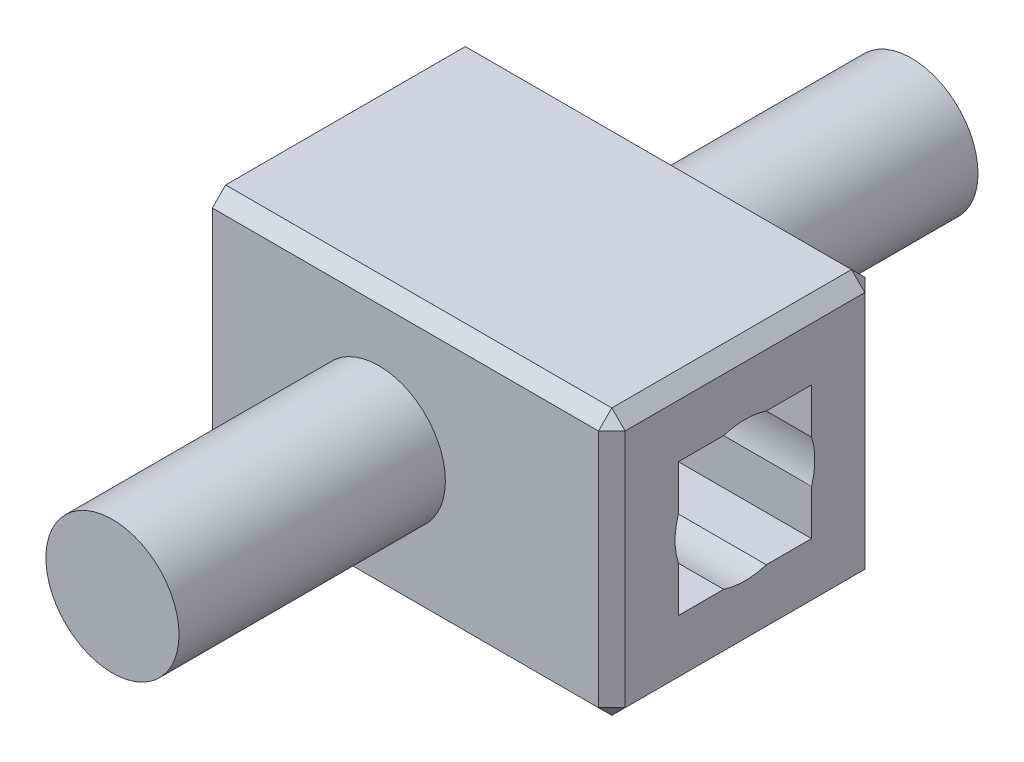
ISO-10303-21;
HEADER;
FILE_DESCRIPTION(('STEP AP214'),'2;1');
FILE_NAME('part.step','',(''),(''),'','','');
FILE_SCHEMA(('AUTOMOTIVE_DESIGN { 1 0 10303 214 1 1 1 1 }'));
ENDSEC;
DATA;
#1=APPLICATION_CONTEXT('core data for automotive mechanical design processes');
#2=APPLICATION_PROTOCOL_DEFINITION('international standard','automotive_design',2000,#1);
#3=PRODUCT_CONTEXT('',#1,'mechanical');
#4=PRODUCT('Part','Part','',(#3));
#5=PRODUCT_RELATED_PRODUCT_CATEGORY('part','',(#4));
#6=PRODUCT_DEFINITION_FORMATION('','',#4);
#7=PRODUCT_DEFINITION_CONTEXT('part definition',#1,'design');
#8=PRODUCT_DEFINITION('design','',#6,#7);
#9=PRODUCT_DEFINITION_SHAPE('','',#8);
#10=(LENGTH_UNIT() NAMED_UNIT(*) SI_UNIT(.MILLI.,.METRE.));
#11=(NAMED_UNIT(*) PLANE_ANGLE_UNIT() SI_UNIT($,.RADIAN.));
#12=(NAMED_UNIT(*) SI_UNIT($,.STERADIAN.) SOLID_ANGLE_UNIT());
#13=UNCERTAINTY_MEASURE_WITH_UNIT(LENGTH_MEASURE(1.E-05),#10,'distance_accuracy_value','');
#14=(GEOMETRIC_REPRESENTATION_CONTEXT(3) GLOBAL_UNCERTAINTY_ASSIGNED_CONTEXT((#13)) GLOBAL_UNIT_ASSIGNED_CONTEXT((#10,
#11,#12)) REPRESENTATION_CONTEXT('',''));
#15=CARTESIAN_POINT('',(0.,0.,0.));
#16=DIRECTION('',(0.,0.,1.));
#17=DIRECTION('',(1.,0.,0.));
#18=AXIS2_PLACEMENT_3D('',#15,#16,#17);
#19=CARTESIAN_POINT('',(-125.,50.,50.));
#20=DIRECTION('',(0.,0.,-1.));
#21=DIRECTION('',(0.,1.,0.));
#22=AXIS2_PLACEMENT_3D('',#19,#20,#21);
#23=PLANE('',#22);
#24=DIRECTION('',(0.,1.,0.));
#25=VECTOR('',#24,1.);
#26=CARTESIAN_POINT('',(-125.,50.,50.));
#27=LINE('',#26,#25);
#28=CARTESIAN_POINT('',(-125.,16.007810593582,50.));
#29=VERTEX_POINT('',#28);
#30=CARTESIAN_POINT('',(-125.,50.,50.));
#31=VERTEX_POINT('',#30);
#32=EDGE_CURVE('E252',#29,#31,#27,.T.);
#33=ORIENTED_EDGE('',*,*,#32,.F.);
#34=DIRECTION('',(1.,0.,0.));
#35=VECTOR('',#34,1.);
#36=CARTESIAN_POINT('',(-125.,16.007810593582,50.));
#37=LINE('',#36,#35);
#38=CARTESIAN_POINT('',(175.,16.0078105935821,50.));
#39=VERTEX_POINT('',#38);
#40=EDGE_CURVE('E537',#29,#39,#37,.T.);
#41=ORIENTED_EDGE('',*,*,#40,.T.);
#42=DIRECTION('',(0.,1.,0.));
#43=VECTOR('',#42,1.);
#44=CARTESIAN_POINT('',(175.,50.,50.));
#45=LINE('',#44,#43);
#46=CARTESIAN_POINT('',(175.,50.,50.));
#47=VERTEX_POINT('',#46);
#48=EDGE_CURVE('E241',#39,#47,#45,.T.);
#49=ORIENTED_EDGE('',*,*,#48,.T.);
#50=DIRECTION('',(1.,0.,0.));
#51=VECTOR('',#50,1.);
#52=CARTESIAN_POINT('',(-125.,50.,50.));
#53=LINE('',#52,#51);
#54=EDGE_CURVE('E264',#31,#47,#53,.T.);
#55=ORIENTED_EDGE('',*,*,#54,.F.);
#56=EDGE_LOOP('',(#33,#41,#49,#55));
#57=FACE_BOUND('',#56,.T.);
#58=ADVANCED_FACE('F51',(#57),#23,.F.);
#59=CARTESIAN_POINT('',(-125.,-50.0000000000001,150.));
#60=DIRECTION('',(0.,-1.,0.));
#61=DIRECTION('',(1.,0.,0.));
#62=AXIS2_PLACEMENT_3D('',#59,#60,#61);
#63=PLANE('',#62);
#64=DIRECTION('',(0.,0.,-1.));
#65=VECTOR('',#64,1.);
#66=CARTESIAN_POINT('',(-125.,-50.0000000000001,150.));
#67=LINE('',#66,#65);
#68=CARTESIAN_POINT('',(-125.,-50.0000000000001,83.9921894064179));
#69=VERTEX_POINT('',#68);
#70=CARTESIAN_POINT('',(-125.,-50.0000000000001,50.));
#71=VERTEX_POINT('',#70);
#72=EDGE_CURVE('E551',#69,#71,#67,.T.);
#73=ORIENTED_EDGE('',*,*,#72,.F.);
#74=DIRECTION('',(1.,0.,0.));
#75=VECTOR('',#74,1.);
#76=CARTESIAN_POINT('',(-125.,-50.0000000000001,83.9921894064179));
#77=LINE('',#76,#75);
#78=CARTESIAN_POINT('',(175.,-50.,83.9921894064179));
#79=VERTEX_POINT('',#78);
#80=EDGE_CURVE('E531',#69,#79,#77,.T.);
#81=ORIENTED_EDGE('',*,*,#80,.T.);
#82=DIRECTION('',(0.,0.,-1.));
#83=VECTOR('',#82,1.);
#84=CARTESIAN_POINT('',(175.,-50.,150.));
#85=LINE('',#84,#83);
#86=CARTESIAN_POINT('',(175.,-50.,50.));
#87=VERTEX_POINT('',#86);
#88=EDGE_CURVE('E247',#79,#87,#85,.T.);
#89=ORIENTED_EDGE('',*,*,#88,.T.);
#90=DIRECTION('',(1.,0.,0.));
#91=VECTOR('',#90,1.);
#92=CARTESIAN_POINT('',(-125.,-50.0000000000001,50.));
#93=LINE('',#92,#91);
#94=EDGE_CURVE('E253',#71,#87,#93,.T.);
#95=ORIENTED_EDGE('',*,*,#94,.F.);
#96=EDGE_LOOP('',(#73,#81,#89,#95));
#97=FACE_BOUND('',#96,.T.);
#98=ADVANCED_FACE('F475',(#97),#63,.F.);
#99=CARTESIAN_POINT('',(-125.,50.,150.));
#100=DIRECTION('',(0.,0.,1.));
#101=DIRECTION('',(1.,0.,0.));
#102=AXIS2_PLACEMENT_3D('',#99,#100,#101);
#103=PLANE('',#102);
#104=DIRECTION('',(0.,-1.,0.));
#105=VECTOR('',#104,1.);
#106=CARTESIAN_POINT('',(-125.,50.,150.));
#107=LINE('',#106,#105);
#108=CARTESIAN_POINT('',(-125.,-16.0078105935822,150.));
#109=VERTEX_POINT('',#108);
#110=CARTESIAN_POINT('',(-125.,-50.0000000000001,150.));
#111=VERTEX_POINT('',#110);
#112=EDGE_CURVE('E547',#109,#111,#107,.T.);
#113=ORIENTED_EDGE('',*,*,#112,.F.);
#114=DIRECTION('',(1.,0.,0.));
#115=VECTOR('',#114,1.);
#116=CARTESIAN_POINT('',(-125.,-16.0078105935822,150.));
#117=LINE('',#116,#115);
#118=CARTESIAN_POINT('',(175.,-16.0078105935821,150.));
#119=VERTEX_POINT('',#118);
#120=EDGE_CURVE('E522',#109,#119,#117,.T.);
#121=ORIENTED_EDGE('',*,*,#120,.T.);
#122=DIRECTION('',(0.,-1.,0.));
#123=VECTOR('',#122,1.);
#124=CARTESIAN_POINT('',(175.,50.,150.));
#125=LINE('',#124,#123);
#126=CARTESIAN_POINT('',(175.,-50.,150.));
#127=VERTEX_POINT('',#126);
#128=EDGE_CURVE('E238',#119,#127,#125,.T.);
#129=ORIENTED_EDGE('',*,*,#128,.T.);
#130=DIRECTION('',(1.,0.,0.));
#131=VECTOR('',#130,1.);
#132=CARTESIAN_POINT('',(-125.,-50.0000000000001,150.));
#133=LINE('',#132,#131);
#134=EDGE_CURVE('E258',#111,#127,#133,.T.);
#135=ORIENTED_EDGE('',*,*,#134,.F.);
#136=EDGE_LOOP('',(#113,#121,#129,#135));
#137=FACE_BOUND('',#136,.T.);
#138=ADVANCED_FACE('F481',(#137),#103,.F.);
#139=CARTESIAN_POINT('',(-125.,50.,150.));
#140=DIRECTION('',(0.,1.,0.));
#141=DIRECTION('',(-1.,0.,0.));
#142=AXIS2_PLACEMENT_3D('',#139,#140,#141);
#143=PLANE('',#142);
#144=DIRECTION('',(0.,0.,1.));
#145=VECTOR('',#144,1.);
#146=CARTESIAN_POINT('',(-125.,50.,150.));
#147=LINE('',#146,#145);
#148=CARTESIAN_POINT('',(-125.,50.,116.007810593582));
#149=VERTEX_POINT('',#148);
#150=CARTESIAN_POINT('',(-125.,50.,150.));
#151=VERTEX_POINT('',#150);
#152=EDGE_CURVE('E220',#149,#151,#147,.T.);
#153=ORIENTED_EDGE('',*,*,#152,.F.);
#154=DIRECTION('',(1.,0.,0.));
#155=VECTOR('',#154,1.);
#156=CARTESIAN_POINT('',(-125.,50.,116.007810593582));
#157=LINE('',#156,#155);
#158=CARTESIAN_POINT('',(175.,50.,116.007810593582));
#159=VERTEX_POINT('',#158);
#160=EDGE_CURVE('E202',#149,#159,#157,.T.);
#161=ORIENTED_EDGE('',*,*,#160,.T.);
#162=DIRECTION('',(0.,0.,1.));
#163=VECTOR('',#162,1.);
#164=CARTESIAN_POINT('',(175.,50.,150.));
#165=LINE('',#164,#163);
#166=CARTESIAN_POINT('',(175.,50.,150.));
#167=VERTEX_POINT('',#166);
#168=EDGE_CURVE('E218',#159,#167,#165,.T.);
#169=ORIENTED_EDGE('',*,*,#168,.T.);
#170=DIRECTION('',(1.,0.,0.));
#171=VECTOR('',#170,1.);
#172=CARTESIAN_POINT('',(-125.,50.,150.));
#173=LINE('',#172,#171);
#174=EDGE_CURVE('E261',#151,#167,#173,.T.);
#175=ORIENTED_EDGE('',*,*,#174,.F.);
#176=EDGE_LOOP('',(#153,#161,#169,#175));
#177=FACE_BOUND('',#176,.T.);
#178=ADVANCED_FACE('F216',(#177),#143,.F.);
#179=CARTESIAN_POINT('',(175.,100.,200.));
#180=DIRECTION('',(-1.,0.,0.));
#181=DIRECTION('',(0.,-1.,0.));
#182=AXIS2_PLACEMENT_3D('',#179,#180,#181);
#183=PLANE('',#182);
#184=DIRECTION('',(0.,-1.,0.));
#185=VECTOR('',#184,1.);
#186=CARTESIAN_POINT('',(175.,100.,190.));
#187=LINE('',#186,#185);
#188=CARTESIAN_POINT('',(175.,89.9999999999999,190.));
#189=VERTEX_POINT('',#188);
#190=CARTESIAN_POINT('',(175.,-90.,190.));
#191=VERTEX_POINT('',#190);
#192=EDGE_CURVE('E344',#189,#191,#187,.T.);
#193=ORIENTED_EDGE('',*,*,#192,.T.);
#194=DIRECTION('',(0.,0.,-1.));
#195=VECTOR('',#194,1.);
#196=CARTESIAN_POINT('',(175.,-90.,200.));
#197=LINE('',#196,#195);
#198=CARTESIAN_POINT('',(175.,-90.,10.));
#199=VERTEX_POINT('',#198);
#200=EDGE_CURVE('E349',#191,#199,#197,.T.);
#201=ORIENTED_EDGE('',*,*,#200,.T.);
#202=DIRECTION('',(0.,1.,0.));
#203=VECTOR('',#202,1.);
#204=CARTESIAN_POINT('',(175.,100.,10.));
#205=LINE('',#204,#203);
#206=CARTESIAN_POINT('',(175.,89.9999999999999,10.));
#207=VERTEX_POINT('',#206);
#208=EDGE_CURVE('E346',#199,#207,#205,.T.);
#209=ORIENTED_EDGE('',*,*,#208,.T.);
#210=DIRECTION('',(0.,0.,1.));
#211=VECTOR('',#210,1.);
#212=CARTESIAN_POINT('',(175.,89.9999999999999,200.));
#213=LINE('',#212,#211);
#214=EDGE_CURVE('E341',#207,#189,#213,.T.);
#215=ORIENTED_EDGE('',*,*,#214,.T.);
#216=EDGE_LOOP('',(#193,#201,#209,#215));
#217=FACE_BOUND('',#216,.T.);
#218=ORIENTED_EDGE('',*,*,#128,.F.);
#219=CARTESIAN_POINT('',(175.,0.,100.));
#220=DIRECTION('',(1.,0.,0.));
#221=DIRECTION('',(0.,1.,0.));
#222=AXIS2_PLACEMENT_3D('',#219,#220,#221);
#223=CIRCLE('',#222,52.5);
#224=CARTESIAN_POINT('',(175.,16.0078105935822,150.));
#225=VERTEX_POINT('',#224);
#226=EDGE_CURVE('E213',#225,#119,#223,.T.);
#227=ORIENTED_EDGE('',*,*,#226,.F.);
#228=EDGE_CURVE('E229',#167,#225,#125,.T.);
#229=ORIENTED_EDGE('',*,*,#228,.F.);
#230=ORIENTED_EDGE('',*,*,#168,.F.);
#231=CARTESIAN_POINT('',(175.,50.,83.9921894064179));
#232=VERTEX_POINT('',#231);
#233=EDGE_CURVE('E199',#232,#159,#223,.T.);
#234=ORIENTED_EDGE('',*,*,#233,.F.);
#235=EDGE_CURVE('E231',#47,#232,#165,.T.);
#236=ORIENTED_EDGE('',*,*,#235,.F.);
#237=ORIENTED_EDGE('',*,*,#48,.F.);
#238=CARTESIAN_POINT('',(175.,-16.007810593582,50.));
#239=VERTEX_POINT('',#238);
#240=EDGE_CURVE('E211',#239,#39,#223,.T.);
#241=ORIENTED_EDGE('',*,*,#240,.F.);
#242=EDGE_CURVE('E232',#87,#239,#45,.T.);
#243=ORIENTED_EDGE('',*,*,#242,.F.);
#244=ORIENTED_EDGE('',*,*,#88,.F.);
#245=CARTESIAN_POINT('',(175.,-50.,116.007810593582));
#246=VERTEX_POINT('',#245);
#247=EDGE_CURVE('E511',#246,#79,#223,.T.);
#248=ORIENTED_EDGE('',*,*,#247,.F.);
#249=EDGE_CURVE('E248',#127,#246,#85,.T.);
#250=ORIENTED_EDGE('',*,*,#249,.F.);
#251=EDGE_LOOP('',(#218,#227,#229,#230,#234,#236,#237,#241,#243,#244,#248,#250));
#252=FACE_BOUND('',#251,.T.);
#253=ADVANCED_FACE('F226',(#217,#252),#183,.F.);
#254=CARTESIAN_POINT('',(-125.,100.,200.));
#255=DIRECTION('',(0.,-1.,0.));
#256=DIRECTION('',(0.,0.,-1.));
#257=AXIS2_PLACEMENT_3D('',#254,#255,#256);
#258=PLANE('',#257);
#259=DIRECTION('',(0.,0.,-1.));
#260=VECTOR('',#259,1.);
#261=CARTESIAN_POINT('',(-125.,100.,200.));
#262=LINE('',#261,#260);
#263=CARTESIAN_POINT('',(-125.,100.,190.));
#264=VERTEX_POINT('',#263);
#265=CARTESIAN_POINT('',(-125.,100.,10.));
#266=VERTEX_POINT('',#265);
#267=EDGE_CURVE('E292',#264,#266,#262,.T.);
#268=ORIENTED_EDGE('',*,*,#267,.F.);
#269=DIRECTION('',(1.,0.,0.));
#270=VECTOR('',#269,1.);
#271=CARTESIAN_POINT('',(-125.,100.,190.));
#272=LINE('',#271,#270);
#273=CARTESIAN_POINT('',(165.,100.,190.));
#274=VERTEX_POINT('',#273);
#275=EDGE_CURVE('E11',#264,#274,#272,.T.);
#276=ORIENTED_EDGE('',*,*,#275,.T.);
#277=DIRECTION('',(0.,0.,-1.));
#278=VECTOR('',#277,1.);
#279=CARTESIAN_POINT('',(165.,100.,200.));
#280=LINE('',#279,#278);
#281=CARTESIAN_POINT('',(165.,100.,10.));
#282=VERTEX_POINT('',#281);
#283=EDGE_CURVE('E62',#274,#282,#280,.T.);
#284=ORIENTED_EDGE('',*,*,#283,.T.);
#285=DIRECTION('',(-1.,0.,0.));
#286=VECTOR('',#285,1.);
#287=CARTESIAN_POINT('',(-125.,100.,10.));
#288=LINE('',#287,#286);
#289=EDGE_CURVE('E353',#282,#266,#288,.T.);
#290=ORIENTED_EDGE('',*,*,#289,.T.);
#291=EDGE_LOOP('',(#268,#276,#284,#290));
#292=FACE_BOUND('',#291,.T.);
#293=ADVANCED_FACE('F413',(#292),#258,.F.);
#294=CARTESIAN_POINT('',(-125.,100.,200.));
#295=DIRECTION('',(1.,0.,0.));
#296=DIRECTION('',(0.,1.,0.));
#297=AXIS2_PLACEMENT_3D('',#294,#295,#296);
#298=PLANE('',#297);
#299=CARTESIAN_POINT('',(-125.,16.0078105935821,150.));
#300=VERTEX_POINT('',#299);
#301=EDGE_CURVE('E548',#151,#300,#107,.T.);
#302=ORIENTED_EDGE('',*,*,#301,.T.);
#303=CARTESIAN_POINT('',(-125.,0.,100.));
#304=DIRECTION('',(1.,0.,0.));
#305=DIRECTION('',(0.,1.,0.));
#306=AXIS2_PLACEMENT_3D('',#303,#304,#305);
#307=CIRCLE('',#306,52.5);
#308=EDGE_CURVE('E523',#300,#109,#307,.T.);
#309=ORIENTED_EDGE('',*,*,#308,.T.);
#310=ORIENTED_EDGE('',*,*,#112,.T.);
#311=CARTESIAN_POINT('',(-125.,-50.0000000000001,116.007810593582));
#312=VERTEX_POINT('',#311);
#313=EDGE_CURVE('E268',#111,#312,#67,.T.);
#314=ORIENTED_EDGE('',*,*,#313,.T.);
#315=EDGE_CURVE('E562',#312,#69,#307,.T.);
#316=ORIENTED_EDGE('',*,*,#315,.T.);
#317=ORIENTED_EDGE('',*,*,#72,.T.);
#318=CARTESIAN_POINT('',(-125.,-16.0078105935821,50.));
#319=VERTEX_POINT('',#318);
#320=EDGE_CURVE('E540',#71,#319,#27,.T.);
#321=ORIENTED_EDGE('',*,*,#320,.T.);
#322=EDGE_CURVE('E587',#319,#29,#307,.T.);
#323=ORIENTED_EDGE('',*,*,#322,.T.);
#324=ORIENTED_EDGE('',*,*,#32,.T.);
#325=CARTESIAN_POINT('',(-125.,50.,83.9921894064179));
#326=VERTEX_POINT('',#325);
#327=EDGE_CURVE('E543',#31,#326,#147,.T.);
#328=ORIENTED_EDGE('',*,*,#327,.T.);
#329=EDGE_CURVE('E517',#326,#149,#307,.T.);
#330=ORIENTED_EDGE('',*,*,#329,.T.);
#331=ORIENTED_EDGE('',*,*,#152,.T.);
#332=EDGE_LOOP('',(#302,#309,#310,#314,#316,#317,#321,#323,#324,#328,#330,#331));
#333=FACE_BOUND('',#332,.T.);
#334=DIRECTION('',(0.,0.,-1.));
#335=VECTOR('',#334,1.);
#336=CARTESIAN_POINT('',(-125.,-100.,200.));
#337=LINE('',#336,#335);
#338=CARTESIAN_POINT('',(-125.,-100.,190.));
#339=VERTEX_POINT('',#338);
#340=CARTESIAN_POINT('',(-125.,-100.,10.));
#341=VERTEX_POINT('',#340);
#342=EDGE_CURVE('E285',#339,#341,#337,.T.);
#343=ORIENTED_EDGE('',*,*,#342,.F.);
#344=DIRECTION('',(0.,-0.707106781186544,-0.707106781186551));
#345=VECTOR('',#344,1.);
#346=CARTESIAN_POINT('',(-125.,-90.,200.));
#347=LINE('',#346,#345);
#348=CARTESIAN_POINT('',(-125.,-90.,200.));
#349=VERTEX_POINT('',#348);
#350=EDGE_CURVE('E329',#339,#349,#347,.F.);
#351=ORIENTED_EDGE('',*,*,#350,.T.);
#352=DIRECTION('',(0.,-1.,0.));
#353=VECTOR('',#352,1.);
#354=CARTESIAN_POINT('',(-125.,100.,200.));
#355=LINE('',#354,#353);
#356=CARTESIAN_POINT('',(-125.,89.9999999999999,200.));
#357=VERTEX_POINT('',#356);
#358=EDGE_CURVE('E281',#357,#349,#355,.T.);
#359=ORIENTED_EDGE('',*,*,#358,.F.);
#360=DIRECTION('',(0.,-0.707106781186551,0.707106781186544));
#361=VECTOR('',#360,1.);
#362=CARTESIAN_POINT('',(-125.,89.9999999999999,200.));
#363=LINE('',#362,#361);
#364=EDGE_CURVE('E323',#357,#264,#363,.F.);
#365=ORIENTED_EDGE('',*,*,#364,.T.);
#366=ORIENTED_EDGE('',*,*,#267,.T.);
#367=DIRECTION('',(0.,-0.707106781186551,-0.707106781186544));
#368=VECTOR('',#367,1.);
#369=CARTESIAN_POINT('',(-125.,100.,10.));
#370=LINE('',#369,#368);
#371=CARTESIAN_POINT('',(-125.,89.9999999999999,0.));
#372=VERTEX_POINT('',#371);
#373=EDGE_CURVE('E320',#266,#372,#370,.T.);
#374=ORIENTED_EDGE('',*,*,#373,.T.);
#375=DIRECTION('',(0.,-1.,0.));
#376=VECTOR('',#375,1.);
#377=CARTESIAN_POINT('',(-125.,100.,0.));
#378=LINE('',#377,#376);
#379=CARTESIAN_POINT('',(-125.,-89.9999999999999,0.));
#380=VERTEX_POINT('',#379);
#381=EDGE_CURVE('E280',#372,#380,#378,.T.);
#382=ORIENTED_EDGE('',*,*,#381,.T.);
#383=DIRECTION('',(0.,-0.707106781186551,0.707106781186544));
#384=VECTOR('',#383,1.);
#385=CARTESIAN_POINT('',(-125.,-100.,10.));
#386=LINE('',#385,#384);
#387=EDGE_CURVE('E326',#380,#341,#386,.T.);
#388=ORIENTED_EDGE('',*,*,#387,.T.);
#389=EDGE_LOOP('',(#343,#351,#359,#365,#366,#374,#382,#388));
#390=FACE_BOUND('',#389,.T.);
#391=ADVANCED_FACE('F416',(#333,#390),#298,.F.);
#392=CARTESIAN_POINT('',(-125.,-100.,200.));
#393=DIRECTION('',(0.,1.,0.));
#394=DIRECTION('',(0.,0.,1.));
#395=AXIS2_PLACEMENT_3D('',#392,#393,#394);
#396=PLANE('',#395);
#397=DIRECTION('',(0.,0.,1.));
#398=VECTOR('',#397,1.);
#399=CARTESIAN_POINT('',(165.,-100.,200.));
#400=LINE('',#399,#398);
#401=CARTESIAN_POINT('',(165.,-100.,10.));
#402=VERTEX_POINT('',#401);
#403=CARTESIAN_POINT('',(165.,-100.,190.));
#404=VERTEX_POINT('',#403);
#405=EDGE_CURVE('E311',#402,#404,#400,.T.);
#406=ORIENTED_EDGE('',*,*,#405,.T.);
#407=DIRECTION('',(-1.,0.,0.));
#408=VECTOR('',#407,1.);
#409=CARTESIAN_POINT('',(-125.,-100.,190.));
#410=LINE('',#409,#408);
#411=EDGE_CURVE('E317',#404,#339,#410,.T.);
#412=ORIENTED_EDGE('',*,*,#411,.T.);
#413=ORIENTED_EDGE('',*,*,#342,.T.);
#414=DIRECTION('',(1.,0.,0.));
#415=VECTOR('',#414,1.);
#416=CARTESIAN_POINT('',(175.,-100.,10.));
#417=LINE('',#416,#415);
#418=EDGE_CURVE('E314',#341,#402,#417,.T.);
#419=ORIENTED_EDGE('',*,*,#418,.T.);
#420=EDGE_LOOP('',(#406,#412,#413,#419));
#421=FACE_BOUND('',#420,.T.);
#422=ADVANCED_FACE('F447',(#421),#396,.F.);
#423=CARTESIAN_POINT('',(0.,0.,200.));
#424=DIRECTION('',(0.,0.,-1.));
#425=DIRECTION('',(-1.,0.,0.));
#426=AXIS2_PLACEMENT_3D('',#423,#424,#425);
#427=PLANE('',#426);
#428=CARTESIAN_POINT('',(0.,0.,200.));
#429=DIRECTION('',(0.,0.,-1.));
#430=DIRECTION('',(-1.,0.,0.));
#431=AXIS2_PLACEMENT_3D('',#428,#429,#430);
#432=CIRCLE('',#431,50.);
#433=CARTESIAN_POINT('',(-50.,0.,200.));
#434=VERTEX_POINT('',#433);
#435=EDGE_CURVE('E276',#434,#434,#432,.T.);
#436=ORIENTED_EDGE('',*,*,#435,.T.);
#437=EDGE_LOOP('',(#436));
#438=FACE_BOUND('',#437,.T.);
#439=ORIENTED_EDGE('',*,*,#358,.T.);
#440=DIRECTION('',(1.,0.,0.));
#441=VECTOR('',#440,1.);
#442=CARTESIAN_POINT('',(0.,-90.,200.));
#443=LINE('',#442,#441);
#444=CARTESIAN_POINT('',(165.,-90.,200.));
#445=VERTEX_POINT('',#444);
#446=EDGE_CURVE('E307',#349,#445,#443,.T.);
#447=ORIENTED_EDGE('',*,*,#446,.T.);
#448=DIRECTION('',(0.,1.,0.));
#449=VECTOR('',#448,1.);
#450=CARTESIAN_POINT('',(165.,0.,200.));
#451=LINE('',#450,#449);
#452=CARTESIAN_POINT('',(165.,89.9999999999999,200.));
#453=VERTEX_POINT('',#452);
#454=EDGE_CURVE('E304',#445,#453,#451,.T.);
#455=ORIENTED_EDGE('',*,*,#454,.T.);
#456=DIRECTION('',(-1.,0.,0.));
#457=VECTOR('',#456,1.);
#458=CARTESIAN_POINT('',(0.,89.9999999999999,200.));
#459=LINE('',#458,#457);
#460=EDGE_CURVE('E222',#453,#357,#459,.T.);
#461=ORIENTED_EDGE('',*,*,#460,.T.);
#462=EDGE_LOOP('',(#439,#447,#455,#461));
#463=FACE_BOUND('',#462,.T.);
#464=ADVANCED_FACE('F462',(#438,#463),#427,.F.);
#465=CARTESIAN_POINT('',(0.,0.,0.));
#466=DIRECTION('',(0.,0.,-1.));
#467=DIRECTION('',(-1.,0.,0.));
#468=AXIS2_PLACEMENT_3D('',#465,#466,#467);
#469=PLANE('',#468);
#470=CARTESIAN_POINT('',(0.,0.,0.));
#471=DIRECTION('',(0.,0.,-1.));
#472=DIRECTION('',(-1.,0.,0.));
#473=AXIS2_PLACEMENT_3D('',#470,#471,#472);
#474=CIRCLE('',#473,50.);
#475=CARTESIAN_POINT('',(-50.,0.,0.));
#476=VERTEX_POINT('',#475);
#477=EDGE_CURVE('E296',#476,#476,#474,.T.);
#478=ORIENTED_EDGE('',*,*,#477,.F.);
#479=EDGE_LOOP('',(#478));
#480=FACE_BOUND('',#479,.T.);
#481=DIRECTION('',(0.,-1.,0.));
#482=VECTOR('',#481,1.);
#483=CARTESIAN_POINT('',(165.,-100.,0.));
#484=LINE('',#483,#482);
#485=CARTESIAN_POINT('',(165.,89.9999999999999,0.));
#486=VERTEX_POINT('',#485);
#487=CARTESIAN_POINT('',(165.,-89.9999999999999,0.));
#488=VERTEX_POINT('',#487);
#489=EDGE_CURVE('E335',#486,#488,#484,.T.);
#490=ORIENTED_EDGE('',*,*,#489,.T.);
#491=DIRECTION('',(-1.,0.,0.));
#492=VECTOR('',#491,1.);
#493=CARTESIAN_POINT('',(-125.,-89.9999999999999,0.));
#494=LINE('',#493,#492);
#495=EDGE_CURVE('E338',#488,#380,#494,.T.);
#496=ORIENTED_EDGE('',*,*,#495,.T.);
#497=ORIENTED_EDGE('',*,*,#381,.F.);
#498=DIRECTION('',(1.,0.,0.));
#499=VECTOR('',#498,1.);
#500=CARTESIAN_POINT('',(175.,89.9999999999999,0.));
#501=LINE('',#500,#499);
#502=EDGE_CURVE('E332',#372,#486,#501,.T.);
#503=ORIENTED_EDGE('',*,*,#502,.T.);
#504=EDGE_LOOP('',(#490,#496,#497,#503));
#505=FACE_BOUND('',#504,.T.);
#506=ADVANCED_FACE('F438',(#480,#505),#469,.T.);
#507=CARTESIAN_POINT('',(0.,0.,-200.));
#508=DIRECTION('',(0.,0.,1.));
#509=DIRECTION('',(1.,0.,0.));
#510=AXIS2_PLACEMENT_3D('',#507,#508,#509);
#511=PLANE('',#510);
#512=CARTESIAN_POINT('',(0.,0.,-200.));
#513=DIRECTION('',(0.,0.,1.));
#514=DIRECTION('',(1.,0.,0.));
#515=AXIS2_PLACEMENT_3D('',#512,#513,#514);
#516=CIRCLE('',#515,50.);
#517=CARTESIAN_POINT('',(50.,0.,-200.));
#518=VERTEX_POINT('',#517);
#519=EDGE_CURVE('E272',#518,#518,#516,.T.);
#520=ORIENTED_EDGE('',*,*,#519,.F.);
#521=EDGE_LOOP('',(#520));
#522=FACE_BOUND('',#521,.T.);
#523=ADVANCED_FACE('F469',(#522),#511,.F.);
#524=CARTESIAN_POINT('',(0.,0.,-200.));
#525=DIRECTION('',(0.,0.,1.));
#526=DIRECTION('',(1.,0.,0.));
#527=AXIS2_PLACEMENT_3D('',#524,#525,#526);
#528=CYLINDRICAL_SURFACE('',#527,50.);
#529=ORIENTED_EDGE('',*,*,#477,.T.);
#530=EDGE_LOOP('',(#529));
#531=FACE_BOUND('',#530,.T.);
#532=ORIENTED_EDGE('',*,*,#519,.T.);
#533=EDGE_LOOP('',(#532));
#534=FACE_BOUND('',#533,.T.);
#535=ADVANCED_FACE('F697',(#531,#534),#528,.T.);
#536=CARTESIAN_POINT('',(0.,0.,400.));
#537=DIRECTION('',(0.,0.,1.));
#538=DIRECTION('',(1.,0.,0.));
#539=AXIS2_PLACEMENT_3D('',#536,#537,#538);
#540=CIRCLE('',#539,50.);
#541=CARTESIAN_POINT('',(50.,0.,400.));
#542=VERTEX_POINT('',#541);
#543=EDGE_CURVE('E257',#542,#542,#540,.T.);
#544=ORIENTED_EDGE('',*,*,#543,.F.);
#545=EDGE_LOOP('',(#544));
#546=FACE_BOUND('',#545,.T.);
#547=ORIENTED_EDGE('',*,*,#435,.F.);
#548=EDGE_LOOP('',(#547));
#549=FACE_BOUND('',#548,.T.);
#550=ADVANCED_FACE('F496',(#546,#549),#528,.T.);
#551=CARTESIAN_POINT('',(0.,0.,400.));
#552=DIRECTION('',(0.,0.,1.));
#553=DIRECTION('',(1.,0.,0.));
#554=AXIS2_PLACEMENT_3D('',#551,#552,#553);
#555=PLANE('',#554);
#556=ORIENTED_EDGE('',*,*,#543,.T.);
#557=EDGE_LOOP('',(#556));
#558=FACE_BOUND('',#557,.T.);
#559=ADVANCED_FACE('F489',(#558),#555,.T.);
#560=ORIENTED_EDGE('',*,*,#242,.T.);
#561=DIRECTION('',(1.,0.,0.));
#562=VECTOR('',#561,1.);
#563=CARTESIAN_POINT('',(-125.,-16.0078105935821,50.));
#564=LINE('',#563,#562);
#565=EDGE_CURVE('E501',#239,#319,#564,.F.);
#566=ORIENTED_EDGE('',*,*,#565,.T.);
#567=ORIENTED_EDGE('',*,*,#320,.F.);
#568=ORIENTED_EDGE('',*,*,#94,.T.);
#569=EDGE_LOOP('',(#560,#566,#567,#568));
#570=FACE_BOUND('',#569,.T.);
#571=ADVANCED_FACE('F478',(#570),#23,.F.);
#572=ORIENTED_EDGE('',*,*,#249,.T.);
#573=DIRECTION('',(1.,0.,0.));
#574=VECTOR('',#573,1.);
#575=CARTESIAN_POINT('',(-125.,-50.0000000000001,116.007810593582));
#576=LINE('',#575,#574);
#577=EDGE_CURVE('E527',#246,#312,#576,.F.);
#578=ORIENTED_EDGE('',*,*,#577,.T.);
#579=ORIENTED_EDGE('',*,*,#313,.F.);
#580=ORIENTED_EDGE('',*,*,#134,.T.);
#581=EDGE_LOOP('',(#572,#578,#579,#580));
#582=FACE_BOUND('',#581,.T.);
#583=ADVANCED_FACE('F484',(#582),#63,.F.);
#584=ORIENTED_EDGE('',*,*,#228,.T.);
#585=DIRECTION('',(1.,0.,0.));
#586=VECTOR('',#585,1.);
#587=CARTESIAN_POINT('',(-125.,16.0078105935821,150.));
#588=LINE('',#587,#586);
#589=EDGE_CURVE('E518',#225,#300,#588,.F.);
#590=ORIENTED_EDGE('',*,*,#589,.T.);
#591=ORIENTED_EDGE('',*,*,#301,.F.);
#592=ORIENTED_EDGE('',*,*,#174,.T.);
#593=EDGE_LOOP('',(#584,#590,#591,#592));
#594=FACE_BOUND('',#593,.T.);
#595=ADVANCED_FACE('F494',(#594),#103,.F.);
#596=ORIENTED_EDGE('',*,*,#235,.T.);
#597=DIRECTION('',(1.,0.,0.));
#598=VECTOR('',#597,1.);
#599=CARTESIAN_POINT('',(-125.,50.,83.9921894064179));
#600=LINE('',#599,#598);
#601=EDGE_CURVE('E205',#232,#326,#600,.F.);
#602=ORIENTED_EDGE('',*,*,#601,.T.);
#603=ORIENTED_EDGE('',*,*,#327,.F.);
#604=ORIENTED_EDGE('',*,*,#54,.T.);
#605=EDGE_LOOP('',(#596,#602,#603,#604));
#606=FACE_BOUND('',#605,.T.);
#607=ADVANCED_FACE('F661',(#606),#143,.F.);
#608=CARTESIAN_POINT('',(-125.,0.,100.));
#609=DIRECTION('',(1.,0.,0.));
#610=DIRECTION('',(0.,1.,0.));
#611=AXIS2_PLACEMENT_3D('',#608,#609,#610);
#612=CYLINDRICAL_SURFACE('',#611,52.5);
#613=ORIENTED_EDGE('',*,*,#329,.F.);
#614=ORIENTED_EDGE('',*,*,#601,.F.);
#615=ORIENTED_EDGE('',*,*,#233,.T.);
#616=ORIENTED_EDGE('',*,*,#160,.F.);
#617=EDGE_LOOP('',(#613,#614,#615,#616));
#618=FACE_BOUND('',#617,.T.);
#619=ADVANCED_FACE('F201',(#618),#612,.F.);
#620=ORIENTED_EDGE('',*,*,#308,.F.);
#621=ORIENTED_EDGE('',*,*,#589,.F.);
#622=ORIENTED_EDGE('',*,*,#226,.T.);
#623=ORIENTED_EDGE('',*,*,#120,.F.);
#624=EDGE_LOOP('',(#620,#621,#622,#623));
#625=FACE_BOUND('',#624,.T.);
#626=ADVANCED_FACE('F653',(#625),#612,.F.);
#627=ORIENTED_EDGE('',*,*,#315,.F.);
#628=ORIENTED_EDGE('',*,*,#577,.F.);
#629=ORIENTED_EDGE('',*,*,#247,.T.);
#630=ORIENTED_EDGE('',*,*,#80,.F.);
#631=EDGE_LOOP('',(#627,#628,#629,#630));
#632=FACE_BOUND('',#631,.T.);
#633=ADVANCED_FACE('F650',(#632),#612,.F.);
#634=ORIENTED_EDGE('',*,*,#322,.F.);
#635=ORIENTED_EDGE('',*,*,#565,.F.);
#636=ORIENTED_EDGE('',*,*,#240,.T.);
#637=ORIENTED_EDGE('',*,*,#40,.F.);
#638=EDGE_LOOP('',(#634,#635,#636,#637));
#639=FACE_BOUND('',#638,.T.);
#640=ADVANCED_FACE('F652',(#639),#612,.F.);
#641=CARTESIAN_POINT('',(-125.,100.,10.));
#642=DIRECTION('',(0.,0.707106781186543,-0.707106781186551));
#643=DIRECTION('',(1.,0.,0.));
#644=AXIS2_PLACEMENT_3D('',#641,#642,#643);
#645=PLANE('',#644);
#646=DIRECTION('',(0.,0.707106781186552,0.707106781186544));
#647=VECTOR('',#646,1.);
#648=CARTESIAN_POINT('',(165.,95.,5.));
#649=LINE('',#648,#647);
#650=EDGE_CURVE('E56',#486,#282,#649,.T.);
#651=ORIENTED_EDGE('',*,*,#650,.F.);
#652=ORIENTED_EDGE('',*,*,#502,.F.);
#653=ORIENTED_EDGE('',*,*,#373,.F.);
#654=ORIENTED_EDGE('',*,*,#289,.F.);
#655=EDGE_LOOP('',(#651,#652,#653,#654));
#656=FACE_BOUND('',#655,.T.);
#657=ADVANCED_FACE('F54',(#656),#645,.T.);
#658=CARTESIAN_POINT('',(175.,89.9999999999999,10.));
#659=DIRECTION('',(0.577350269189626,0.577350269189619,-0.577350269189632));
#660=DIRECTION('',(-0.707106781186551,0.,-0.707106781186544));
#661=AXIS2_PLACEMENT_3D('',#658,#659,#660);
#662=PLANE('',#661);
#663=DIRECTION('',(-0.707106781186551,0.,-0.707106781186544));
#664=VECTOR('',#663,1.);
#665=CARTESIAN_POINT('',(175.,89.9999999999999,10.));
#666=LINE('',#665,#664);
#667=EDGE_CURVE('E392',#486,#207,#666,.F.);
#668=ORIENTED_EDGE('',*,*,#667,.F.);
#669=ORIENTED_EDGE('',*,*,#650,.T.);
#670=DIRECTION('',(-0.707106781186544,0.707106781186552,0.));
#671=VECTOR('',#670,1.);
#672=CARTESIAN_POINT('',(175.,89.9999999999999,10.));
#673=LINE('',#672,#671);
#674=EDGE_CURVE('E395',#207,#282,#673,.T.);
#675=ORIENTED_EDGE('',*,*,#674,.F.);
#676=EDGE_LOOP('',(#668,#669,#675));
#677=FACE_BOUND('',#676,.T.);
#678=ADVANCED_FACE('F408',(#677),#662,.T.);
#679=CARTESIAN_POINT('',(0.,89.9999999999999,200.));
#680=DIRECTION('',(0.,-0.707106781186543,-0.707106781186551));
#681=DIRECTION('',(-1.,0.,0.));
#682=AXIS2_PLACEMENT_3D('',#679,#680,#681);
#683=PLANE('',#682);
#684=ORIENTED_EDGE('',*,*,#364,.F.);
#685=ORIENTED_EDGE('',*,*,#460,.F.);
#686=DIRECTION('',(0.,0.707106781186552,-0.707106781186544));
#687=VECTOR('',#686,1.);
#688=CARTESIAN_POINT('',(165.,89.9999999999999,200.));
#689=LINE('',#688,#687);
#690=EDGE_CURVE('E388',#274,#453,#689,.F.);
#691=ORIENTED_EDGE('',*,*,#690,.F.);
#692=ORIENTED_EDGE('',*,*,#275,.F.);
#693=EDGE_LOOP('',(#684,#685,#691,#692));
#694=FACE_BOUND('',#693,.T.);
#695=ADVANCED_FACE('F422',(#694),#683,.F.);
#696=CARTESIAN_POINT('',(165.,100.,200.));
#697=DIRECTION('',(-0.707106781186551,-0.707106781186543,0.));
#698=DIRECTION('',(0.,0.,-1.));
#699=AXIS2_PLACEMENT_3D('',#696,#697,#698);
#700=PLANE('',#699);
#701=ORIENTED_EDGE('',*,*,#674,.T.);
#702=ORIENTED_EDGE('',*,*,#283,.F.);
#703=DIRECTION('',(0.707106781186544,-0.707106781186552,0.));
#704=VECTOR('',#703,1.);
#705=CARTESIAN_POINT('',(170.,95.,190.));
#706=LINE('',#705,#704);
#707=EDGE_CURVE('E384',#189,#274,#706,.F.);
#708=ORIENTED_EDGE('',*,*,#707,.F.);
#709=ORIENTED_EDGE('',*,*,#214,.F.);
#710=EDGE_LOOP('',(#701,#702,#708,#709));
#711=FACE_BOUND('',#710,.T.);
#712=ADVANCED_FACE('F429',(#711),#700,.F.);
#713=CARTESIAN_POINT('',(175.,100.,10.));
#714=DIRECTION('',(0.707106781186543,0.,-0.707106781186551));
#715=DIRECTION('',(0.,-1.,0.));
#716=AXIS2_PLACEMENT_3D('',#713,#714,#715);
#717=PLANE('',#716);
#718=ORIENTED_EDGE('',*,*,#667,.T.);
#719=ORIENTED_EDGE('',*,*,#208,.F.);
#720=DIRECTION('',(0.707106781186551,0.,0.707106781186544));
#721=VECTOR('',#720,1.);
#722=CARTESIAN_POINT('',(170.,-89.9999999999999,4.99999999999999));
#723=LINE('',#722,#721);
#724=EDGE_CURVE('E380',#488,#199,#723,.T.);
#725=ORIENTED_EDGE('',*,*,#724,.F.);
#726=ORIENTED_EDGE('',*,*,#489,.F.);
#727=EDGE_LOOP('',(#718,#719,#725,#726));
#728=FACE_BOUND('',#727,.T.);
#729=ADVANCED_FACE('F435',(#728),#717,.T.);
#730=CARTESIAN_POINT('',(-125.,-100.,10.));
#731=DIRECTION('',(0.,-0.707106781186543,-0.707106781186551));
#732=DIRECTION('',(-1.,0.,0.));
#733=AXIS2_PLACEMENT_3D('',#730,#731,#732);
#734=PLANE('',#733);
#735=ORIENTED_EDGE('',*,*,#387,.F.);
#736=ORIENTED_EDGE('',*,*,#495,.F.);
#737=DIRECTION('',(0.,0.707106781186551,-0.707106781186544));
#738=VECTOR('',#737,1.);
#739=CARTESIAN_POINT('',(165.,-100.,10.));
#740=LINE('',#739,#738);
#741=EDGE_CURVE('E376',#402,#488,#740,.T.);
#742=ORIENTED_EDGE('',*,*,#741,.F.);
#743=ORIENTED_EDGE('',*,*,#418,.F.);
#744=EDGE_LOOP('',(#735,#736,#742,#743));
#745=FACE_BOUND('',#744,.T.);
#746=ADVANCED_FACE('F442',(#745),#734,.T.);
#747=CARTESIAN_POINT('',(165.,89.9999999999999,200.));
#748=DIRECTION('',(0.577350269189632,0.577350269189619,0.577350269189626));
#749=DIRECTION('',(0.707106781186544,0.,-0.707106781186551));
#750=AXIS2_PLACEMENT_3D('',#747,#748,#749);
#751=PLANE('',#750);
#752=ORIENTED_EDGE('',*,*,#707,.T.);
#753=ORIENTED_EDGE('',*,*,#690,.T.);
#754=DIRECTION('',(-0.707106781186544,0.,0.707106781186551));
#755=VECTOR('',#754,1.);
#756=CARTESIAN_POINT('',(165.,89.9999999999999,200.));
#757=LINE('',#756,#755);
#758=EDGE_CURVE('E372',#189,#453,#757,.T.);
#759=ORIENTED_EDGE('',*,*,#758,.F.);
#760=EDGE_LOOP('',(#752,#753,#759));
#761=FACE_BOUND('',#760,.T.);
#762=ADVANCED_FACE('F427',(#761),#751,.T.);
#763=CARTESIAN_POINT('',(165.,-100.,10.));
#764=DIRECTION('',(0.577350269189619,-0.577350269189627,-0.577350269189632));
#765=DIRECTION('',(0.,0.707106781186551,-0.707106781186545));
#766=AXIS2_PLACEMENT_3D('',#763,#764,#765);
#767=PLANE('',#766);
#768=ORIENTED_EDGE('',*,*,#741,.T.);
#769=ORIENTED_EDGE('',*,*,#724,.T.);
#770=DIRECTION('',(0.707106781186552,0.707106781186543,0.));
#771=VECTOR('',#770,1.);
#772=CARTESIAN_POINT('',(165.,-100.,10.));
#773=LINE('',#772,#771);
#774=EDGE_CURVE('E369',#402,#199,#773,.T.);
#775=ORIENTED_EDGE('',*,*,#774,.F.);
#776=EDGE_LOOP('',(#768,#769,#775));
#777=FACE_BOUND('',#776,.T.);
#778=ADVANCED_FACE('F779',(#777),#767,.T.);
#779=CARTESIAN_POINT('',(165.,0.,200.));
#780=DIRECTION('',(-0.707106781186551,0.,-0.707106781186543));
#781=DIRECTION('',(0.,1.,0.));
#782=AXIS2_PLACEMENT_3D('',#779,#780,#781);
#783=PLANE('',#782);
#784=ORIENTED_EDGE('',*,*,#758,.T.);
#785=ORIENTED_EDGE('',*,*,#454,.F.);
#786=DIRECTION('',(0.707106781186544,0.,-0.707106781186551));
#787=VECTOR('',#786,1.);
#788=CARTESIAN_POINT('',(165.,-90.,200.));
#789=LINE('',#788,#787);
#790=EDGE_CURVE('E365',#191,#445,#789,.F.);
#791=ORIENTED_EDGE('',*,*,#790,.F.);
#792=ORIENTED_EDGE('',*,*,#192,.F.);
#793=EDGE_LOOP('',(#784,#785,#791,#792));
#794=FACE_BOUND('',#793,.T.);
#795=ADVANCED_FACE('F460',(#794),#783,.F.);
#796=CARTESIAN_POINT('',(175.,-90.,200.));
#797=DIRECTION('',(-0.707106781186543,0.707106781186552,0.));
#798=DIRECTION('',(0.,0.,-1.));
#799=AXIS2_PLACEMENT_3D('',#796,#797,#798);
#800=PLANE('',#799);
#801=ORIENTED_EDGE('',*,*,#774,.T.);
#802=ORIENTED_EDGE('',*,*,#200,.F.);
#803=DIRECTION('',(-0.707106781186552,-0.707106781186543,0.));
#804=VECTOR('',#803,1.);
#805=CARTESIAN_POINT('',(170.,-95.,190.));
#806=LINE('',#805,#804);
#807=EDGE_CURVE('E361',#404,#191,#806,.F.);
#808=ORIENTED_EDGE('',*,*,#807,.F.);
#809=ORIENTED_EDGE('',*,*,#405,.F.);
#810=EDGE_LOOP('',(#801,#802,#808,#809));
#811=FACE_BOUND('',#810,.T.);
#812=ADVANCED_FACE('F797',(#811),#800,.F.);
#813=CARTESIAN_POINT('',(165.,-90.,200.));
#814=DIRECTION('',(0.577350269189625,-0.577350269189633,0.577350269189619));
#815=DIRECTION('',(0.707106781186552,0.707106781186543,0.));
#816=AXIS2_PLACEMENT_3D('',#813,#814,#815);
#817=PLANE('',#816);
#818=ORIENTED_EDGE('',*,*,#807,.T.);
#819=ORIENTED_EDGE('',*,*,#790,.T.);
#820=DIRECTION('',(0.,0.707106781186544,0.707106781186551));
#821=VECTOR('',#820,1.);
#822=CARTESIAN_POINT('',(165.,-90.,200.));
#823=LINE('',#822,#821);
#824=EDGE_CURVE('E358',#404,#445,#823,.T.);
#825=ORIENTED_EDGE('',*,*,#824,.F.);
#826=EDGE_LOOP('',(#818,#819,#825));
#827=FACE_BOUND('',#826,.T.);
#828=ADVANCED_FACE('F456',(#827),#817,.T.);
#829=CARTESIAN_POINT('',(0.,-90.,200.));
#830=DIRECTION('',(0.,0.707106781186551,-0.707106781186543));
#831=DIRECTION('',(1.,0.,0.));
#832=AXIS2_PLACEMENT_3D('',#829,#830,#831);
#833=PLANE('',#832);
#834=ORIENTED_EDGE('',*,*,#350,.F.);
#835=ORIENTED_EDGE('',*,*,#411,.F.);
#836=ORIENTED_EDGE('',*,*,#824,.T.);
#837=ORIENTED_EDGE('',*,*,#446,.F.);
#838=EDGE_LOOP('',(#834,#835,#836,#837));
#839=FACE_BOUND('',#838,.T.);
#840=ADVANCED_FACE('F453',(#839),#833,.F.);
#841=CLOSED_SHELL('',(#58,#98,#138,#178,#253,#293,#391,#422,#464,#506,#523,#535,#550,#559,#571,
#583,#595,#607,#619,#626,#633,#640,#657,#678,#695,#712,#729,#746,#762,#778,#795,#812,#828,#840));
#842=MANIFOLD_SOLID_BREP('B2',#841);
#843=ADVANCED_BREP_SHAPE_REPRESENTATION('',(#18,#842),#14);
#844=SHAPE_DEFINITION_REPRESENTATION(#9,#843);
ENDSEC;
END-ISO-10303-21;
